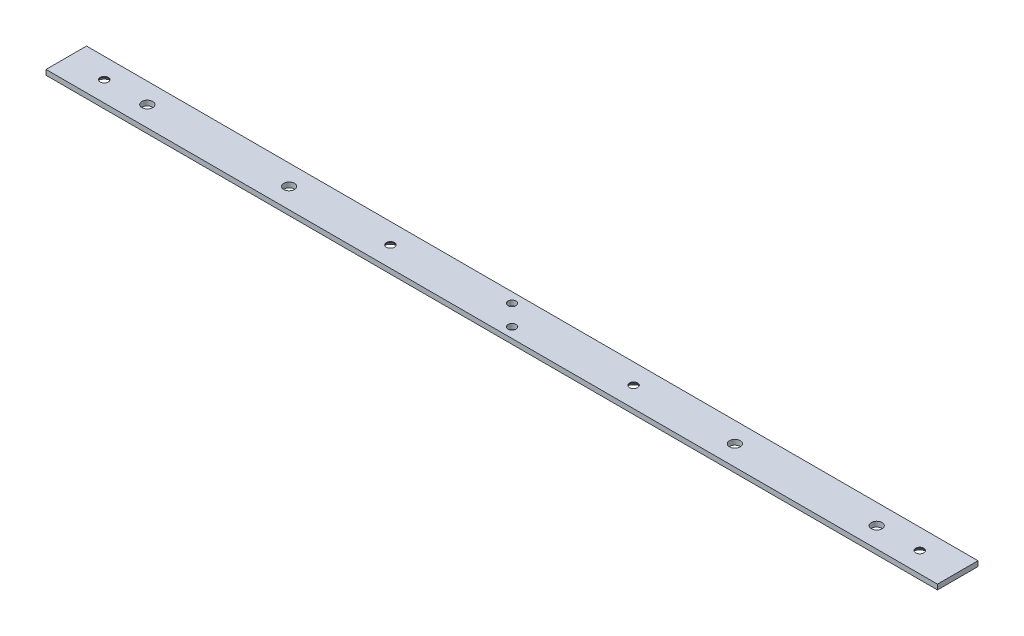
ISO-10303-21;
HEADER;
FILE_DESCRIPTION(('STEP AP214'),'2;1');
FILE_NAME('part.step','',(''),(''),'','','');
FILE_SCHEMA(('AUTOMOTIVE_DESIGN { 1 0 10303 214 1 1 1 1 }'));
ENDSEC;
DATA;
#1=APPLICATION_CONTEXT('core data for automotive mechanical design processes');
#2=APPLICATION_PROTOCOL_DEFINITION('international standard','automotive_design',2000,#1);
#3=PRODUCT_CONTEXT('',#1,'mechanical');
#4=PRODUCT('Part','Part','',(#3));
#5=PRODUCT_RELATED_PRODUCT_CATEGORY('part','',(#4));
#6=PRODUCT_DEFINITION_FORMATION('','',#4);
#7=PRODUCT_DEFINITION_CONTEXT('part definition',#1,'design');
#8=PRODUCT_DEFINITION('design','',#6,#7);
#9=PRODUCT_DEFINITION_SHAPE('','',#8);
#10=(LENGTH_UNIT() NAMED_UNIT(*) SI_UNIT(.MILLI.,.METRE.));
#11=(NAMED_UNIT(*) PLANE_ANGLE_UNIT() SI_UNIT($,.RADIAN.));
#12=(NAMED_UNIT(*) SI_UNIT($,.STERADIAN.) SOLID_ANGLE_UNIT());
#13=UNCERTAINTY_MEASURE_WITH_UNIT(LENGTH_MEASURE(1.E-05),#10,'distance_accuracy_value','');
#14=(GEOMETRIC_REPRESENTATION_CONTEXT(3) GLOBAL_UNCERTAINTY_ASSIGNED_CONTEXT((#13)) GLOBAL_UNIT_ASSIGNED_CONTEXT((#10,
#11,#12)) REPRESENTATION_CONTEXT('',''));
#15=CARTESIAN_POINT('',(0.,0.,0.));
#16=DIRECTION('',(0.,0.,1.));
#17=DIRECTION('',(1.,0.,0.));
#18=AXIS2_PLACEMENT_3D('',#15,#16,#17);
#19=CARTESIAN_POINT('',(279.4,1.5875,12.7));
#20=DIRECTION('',(0.,-1.,0.));
#21=DIRECTION('',(0.,0.,-1.));
#22=AXIS2_PLACEMENT_3D('',#19,#20,#21);
#23=PLANE('',#22);
#24=CARTESIAN_POINT('',(-76.2,1.58749999999999,3.46944695195361E-12));
#25=DIRECTION('',(0.,-1.,0.));
#26=DIRECTION('',(0.,0.,-1.));
#27=AXIS2_PLACEMENT_3D('',#24,#25,#26);
#28=CIRCLE('',#27,2.55269999999999);
#29=CARTESIAN_POINT('',(-76.2,1.58749999999999,-2.55269999999652));
#30=VERTEX_POINT('',#29);
#31=EDGE_CURVE('E188',#30,#30,#28,.T.);
#32=ORIENTED_EDGE('',*,*,#31,.T.);
#33=EDGE_LOOP('',(#32));
#34=FACE_BOUND('',#33,.T.);
#35=CARTESIAN_POINT('',(-255.5875,1.58749999999999,3.44169137633799E-12));
#36=DIRECTION('',(0.,-1.,0.));
#37=DIRECTION('',(0.,0.,-1.));
#38=AXIS2_PLACEMENT_3D('',#35,#36,#37);
#39=CIRCLE('',#38,2.55269999999996);
#40=CARTESIAN_POINT('',(-255.5875,1.58749999999999,-2.55269999999652));
#41=VERTEX_POINT('',#40);
#42=EDGE_CURVE('E179',#41,#41,#39,.T.);
#43=ORIENTED_EDGE('',*,*,#42,.T.);
#44=EDGE_LOOP('',(#43));
#45=FACE_BOUND('',#44,.T.);
#46=CARTESIAN_POINT('',(255.5875,1.58749999999999,3.4555691641458E-12));
#47=DIRECTION('',(0.,-1.,0.));
#48=DIRECTION('',(0.,0.,-1.));
#49=AXIS2_PLACEMENT_3D('',#46,#47,#48);
#50=CIRCLE('',#49,2.55269999999996);
#51=CARTESIAN_POINT('',(255.5875,1.58749999999999,-2.55269999999651));
#52=VERTEX_POINT('',#51);
#53=EDGE_CURVE('E170',#52,#52,#50,.T.);
#54=ORIENTED_EDGE('',*,*,#53,.T.);
#55=EDGE_LOOP('',(#54));
#56=FACE_BOUND('',#55,.T.);
#57=CARTESIAN_POINT('',(76.2,1.58749999999999,3.48332473976143E-12));
#58=DIRECTION('',(0.,-1.,0.));
#59=DIRECTION('',(0.,0.,-1.));
#60=AXIS2_PLACEMENT_3D('',#57,#58,#59);
#61=CIRCLE('',#60,2.55269999999999);
#62=CARTESIAN_POINT('',(76.2,1.58749999999999,-2.55269999999651));
#63=VERTEX_POINT('',#62);
#64=EDGE_CURVE('E161',#63,#63,#61,.T.);
#65=ORIENTED_EDGE('',*,*,#64,.T.);
#66=EDGE_LOOP('',(#65));
#67=FACE_BOUND('',#66,.T.);
#68=CARTESIAN_POINT('',(6.35,1.5875,6.35));
#69=DIRECTION('',(0.,1.,0.));
#70=DIRECTION('',(0.,0.,1.));
#71=AXIS2_PLACEMENT_3D('',#68,#69,#70);
#72=CIRCLE('',#71,2.5527);
#73=CARTESIAN_POINT('',(6.35,1.5875,8.9027));
#74=VERTEX_POINT('',#73);
#75=EDGE_CURVE('E158',#74,#74,#72,.T.);
#76=ORIENTED_EDGE('',*,*,#75,.F.);
#77=EDGE_LOOP('',(#76));
#78=FACE_BOUND('',#77,.T.);
#79=CARTESIAN_POINT('',(-6.35,1.5875,-6.35));
#80=DIRECTION('',(0.,1.,0.));
#81=DIRECTION('',(0.,0.,1.));
#82=AXIS2_PLACEMENT_3D('',#79,#80,#81);
#83=CIRCLE('',#82,2.5527);
#84=CARTESIAN_POINT('',(-6.35,1.5875,-3.7973));
#85=VERTEX_POINT('',#84);
#86=EDGE_CURVE('E152',#85,#85,#83,.T.);
#87=ORIENTED_EDGE('',*,*,#86,.F.);
#88=EDGE_LOOP('',(#87));
#89=FACE_BOUND('',#88,.T.);
#90=CARTESIAN_POINT('',(139.7,1.5875,0.));
#91=DIRECTION('',(0.,1.,0.));
#92=DIRECTION('',(0.,0.,1.));
#93=AXIS2_PLACEMENT_3D('',#90,#91,#92);
#94=CIRCLE('',#93,3.3782);
#95=CARTESIAN_POINT('',(139.7,1.5875,3.3781999999999));
#96=VERTEX_POINT('',#95);
#97=EDGE_CURVE('E140',#96,#96,#94,.T.);
#98=ORIENTED_EDGE('',*,*,#97,.F.);
#99=EDGE_LOOP('',(#98));
#100=FACE_BOUND('',#99,.T.);
#101=CARTESIAN_POINT('',(-228.6,1.5875,0.));
#102=DIRECTION('',(0.,1.,0.));
#103=DIRECTION('',(0.,0.,1.));
#104=AXIS2_PLACEMENT_3D('',#101,#102,#103);
#105=CIRCLE('',#104,3.3782);
#106=CARTESIAN_POINT('',(-228.6,1.5875,3.3782));
#107=VERTEX_POINT('',#106);
#108=EDGE_CURVE('E134',#107,#107,#105,.T.);
#109=ORIENTED_EDGE('',*,*,#108,.F.);
#110=EDGE_LOOP('',(#109));
#111=FACE_BOUND('',#110,.T.);
#112=CARTESIAN_POINT('',(-139.7,1.5875,0.));
#113=DIRECTION('',(0.,1.,0.));
#114=DIRECTION('',(0.,0.,1.));
#115=AXIS2_PLACEMENT_3D('',#112,#113,#114);
#116=CIRCLE('',#115,3.3782);
#117=CARTESIAN_POINT('',(-139.7,1.5875,3.3781999999999));
#118=VERTEX_POINT('',#117);
#119=EDGE_CURVE('E128',#118,#118,#116,.T.);
#120=ORIENTED_EDGE('',*,*,#119,.F.);
#121=EDGE_LOOP('',(#120));
#122=FACE_BOUND('',#121,.T.);
#123=DIRECTION('',(0.,0.,1.));
#124=VECTOR('',#123,1.);
#125=CARTESIAN_POINT('',(-279.4,1.5875,12.7));
#126=LINE('',#125,#124);
#127=CARTESIAN_POINT('',(-279.4,1.5875,-12.7));
#128=VERTEX_POINT('',#127);
#129=CARTESIAN_POINT('',(-279.4,1.5875,12.7));
#130=VERTEX_POINT('',#129);
#131=EDGE_CURVE('E104',#128,#130,#126,.T.);
#132=ORIENTED_EDGE('',*,*,#131,.T.);
#133=DIRECTION('',(-1.,0.,0.));
#134=VECTOR('',#133,1.);
#135=CARTESIAN_POINT('',(279.4,1.5875,12.7));
#136=LINE('',#135,#134);
#137=CARTESIAN_POINT('',(279.4,1.5875,12.7));
#138=VERTEX_POINT('',#137);
#139=EDGE_CURVE('E57',#138,#130,#136,.T.);
#140=ORIENTED_EDGE('',*,*,#139,.F.);
#141=DIRECTION('',(0.,0.,1.));
#142=VECTOR('',#141,1.);
#143=CARTESIAN_POINT('',(279.4,1.5875,12.7));
#144=LINE('',#143,#142);
#145=CARTESIAN_POINT('',(279.4,1.5875,-12.7));
#146=VERTEX_POINT('',#145);
#147=EDGE_CURVE('E95',#146,#138,#144,.T.);
#148=ORIENTED_EDGE('',*,*,#147,.F.);
#149=DIRECTION('',(-1.,0.,0.));
#150=VECTOR('',#149,1.);
#151=CARTESIAN_POINT('',(279.4,1.5875,-12.7));
#152=LINE('',#151,#150);
#153=EDGE_CURVE('E13',#146,#128,#152,.T.);
#154=ORIENTED_EDGE('',*,*,#153,.T.);
#155=EDGE_LOOP('',(#132,#140,#148,#154));
#156=FACE_BOUND('',#155,.T.);
#157=CARTESIAN_POINT('',(228.6,1.5875,0.));
#158=DIRECTION('',(0.,1.,0.));
#159=DIRECTION('',(0.,0.,1.));
#160=AXIS2_PLACEMENT_3D('',#157,#158,#159);
#161=CIRCLE('',#160,3.3782);
#162=CARTESIAN_POINT('',(228.6,1.5875,3.3782));
#163=VERTEX_POINT('',#162);
#164=EDGE_CURVE('E146',#163,#163,#161,.T.);
#165=ORIENTED_EDGE('',*,*,#164,.F.);
#166=EDGE_LOOP('',(#165));
#167=FACE_BOUND('',#166,.T.);
#168=ADVANCED_FACE('F48',(#34,#45,#56,#67,#78,#89,#100,#111,#122,#156,#167),#23,.F.);
#169=CARTESIAN_POINT('',(279.4,1.5875,-12.7));
#170=DIRECTION('',(0.,0.,1.));
#171=DIRECTION('',(1.,0.,0.));
#172=AXIS2_PLACEMENT_3D('',#169,#170,#171);
#173=PLANE('',#172);
#174=DIRECTION('',(0.,1.,0.));
#175=VECTOR('',#174,1.);
#176=CARTESIAN_POINT('',(-279.4,1.5875,-12.7));
#177=LINE('',#176,#175);
#178=CARTESIAN_POINT('',(-279.4,-1.5875,-12.7));
#179=VERTEX_POINT('',#178);
#180=EDGE_CURVE('E112',#179,#128,#177,.T.);
#181=ORIENTED_EDGE('',*,*,#180,.T.);
#182=ORIENTED_EDGE('',*,*,#153,.F.);
#183=DIRECTION('',(0.,1.,0.));
#184=VECTOR('',#183,1.);
#185=CARTESIAN_POINT('',(279.4,1.5875,-12.7));
#186=LINE('',#185,#184);
#187=CARTESIAN_POINT('',(279.4,-1.5875,-12.7));
#188=VERTEX_POINT('',#187);
#189=EDGE_CURVE('E100',#188,#146,#186,.T.);
#190=ORIENTED_EDGE('',*,*,#189,.F.);
#191=DIRECTION('',(-1.,0.,0.));
#192=VECTOR('',#191,1.);
#193=CARTESIAN_POINT('',(279.4,-1.5875,-12.7));
#194=LINE('',#193,#192);
#195=EDGE_CURVE('E108',#188,#179,#194,.T.);
#196=ORIENTED_EDGE('',*,*,#195,.T.);
#197=EDGE_LOOP('',(#181,#182,#190,#196));
#198=FACE_BOUND('',#197,.T.);
#199=ADVANCED_FACE('F50',(#198),#173,.F.);
#200=CARTESIAN_POINT('',(279.4,1.5875,12.7));
#201=DIRECTION('',(0.,0.,-1.));
#202=DIRECTION('',(-1.,0.,0.));
#203=AXIS2_PLACEMENT_3D('',#200,#201,#202);
#204=PLANE('',#203);
#205=DIRECTION('',(0.,-1.,0.));
#206=VECTOR('',#205,1.);
#207=CARTESIAN_POINT('',(-279.4,1.5875,12.7));
#208=LINE('',#207,#206);
#209=CARTESIAN_POINT('',(-279.4,-1.5875,12.7));
#210=VERTEX_POINT('',#209);
#211=EDGE_CURVE('E82',#130,#210,#208,.T.);
#212=ORIENTED_EDGE('',*,*,#211,.T.);
#213=DIRECTION('',(-1.,0.,0.));
#214=VECTOR('',#213,1.);
#215=CARTESIAN_POINT('',(279.4,-1.5875,12.7));
#216=LINE('',#215,#214);
#217=CARTESIAN_POINT('',(279.4,-1.5875,12.7));
#218=VERTEX_POINT('',#217);
#219=EDGE_CURVE('E105',#218,#210,#216,.T.);
#220=ORIENTED_EDGE('',*,*,#219,.F.);
#221=DIRECTION('',(0.,-1.,0.));
#222=VECTOR('',#221,1.);
#223=CARTESIAN_POINT('',(279.4,1.5875,12.7));
#224=LINE('',#223,#222);
#225=EDGE_CURVE('E98',#138,#218,#224,.T.);
#226=ORIENTED_EDGE('',*,*,#225,.F.);
#227=ORIENTED_EDGE('',*,*,#139,.T.);
#228=EDGE_LOOP('',(#212,#220,#226,#227));
#229=FACE_BOUND('',#228,.T.);
#230=ADVANCED_FACE('F106',(#229),#204,.F.);
#231=CARTESIAN_POINT('',(279.4,-1.5875,12.7));
#232=DIRECTION('',(0.,1.,0.));
#233=DIRECTION('',(0.,0.,1.));
#234=AXIS2_PLACEMENT_3D('',#231,#232,#233);
#235=PLANE('',#234);
#236=CARTESIAN_POINT('',(-76.2,-1.58749999999999,3.46944695195361E-12));
#237=DIRECTION('',(0.,-1.,0.));
#238=DIRECTION('',(0.,0.,-1.));
#239=AXIS2_PLACEMENT_3D('',#236,#237,#238);
#240=CIRCLE('',#239,4.88950000000001);
#241=CARTESIAN_POINT('',(-76.2,-1.58749999999999,-4.88949999999654));
#242=VERTEX_POINT('',#241);
#243=EDGE_CURVE('E194',#242,#242,#240,.T.);
#244=ORIENTED_EDGE('',*,*,#243,.F.);
#245=EDGE_LOOP('',(#244));
#246=FACE_BOUND('',#245,.T.);
#247=CARTESIAN_POINT('',(-255.5875,-1.58749999999999,3.44169137633799E-12));
#248=DIRECTION('',(0.,-1.,0.));
#249=DIRECTION('',(0.,0.,-1.));
#250=AXIS2_PLACEMENT_3D('',#247,#248,#249);
#251=CIRCLE('',#250,4.88949999999999);
#252=CARTESIAN_POINT('',(-255.5875,-1.58749999999999,-4.88949999999655));
#253=VERTEX_POINT('',#252);
#254=EDGE_CURVE('E185',#253,#253,#251,.T.);
#255=ORIENTED_EDGE('',*,*,#254,.F.);
#256=EDGE_LOOP('',(#255));
#257=FACE_BOUND('',#256,.T.);
#258=CARTESIAN_POINT('',(255.5875,-1.58749999999999,3.4555691641458E-12));
#259=DIRECTION('',(0.,-1.,0.));
#260=DIRECTION('',(0.,0.,-1.));
#261=AXIS2_PLACEMENT_3D('',#258,#259,#260);
#262=CIRCLE('',#261,4.88949999999999);
#263=CARTESIAN_POINT('',(255.5875,-1.58749999999999,-4.88949999999654));
#264=VERTEX_POINT('',#263);
#265=EDGE_CURVE('E176',#264,#264,#262,.T.);
#266=ORIENTED_EDGE('',*,*,#265,.F.);
#267=EDGE_LOOP('',(#266));
#268=FACE_BOUND('',#267,.T.);
#269=CARTESIAN_POINT('',(76.2,-1.58749999999999,3.48332473976143E-12));
#270=DIRECTION('',(0.,-1.,0.));
#271=DIRECTION('',(0.,0.,-1.));
#272=AXIS2_PLACEMENT_3D('',#269,#270,#271);
#273=CIRCLE('',#272,4.88950000000001);
#274=CARTESIAN_POINT('',(76.2,-1.58749999999999,-4.88949999999652));
#275=VERTEX_POINT('',#274);
#276=EDGE_CURVE('E167',#275,#275,#273,.T.);
#277=ORIENTED_EDGE('',*,*,#276,.F.);
#278=EDGE_LOOP('',(#277));
#279=FACE_BOUND('',#278,.T.);
#280=CARTESIAN_POINT('',(6.35,-1.5875,6.35));
#281=DIRECTION('',(0.,1.,0.));
#282=DIRECTION('',(0.,0.,1.));
#283=AXIS2_PLACEMENT_3D('',#280,#281,#282);
#284=CIRCLE('',#283,2.5527);
#285=CARTESIAN_POINT('',(6.35,-1.5875,8.9027));
#286=VERTEX_POINT('',#285);
#287=EDGE_CURVE('E155',#286,#286,#284,.T.);
#288=ORIENTED_EDGE('',*,*,#287,.T.);
#289=EDGE_LOOP('',(#288));
#290=FACE_BOUND('',#289,.T.);
#291=CARTESIAN_POINT('',(-6.35,-1.5875,-6.35));
#292=DIRECTION('',(0.,1.,0.));
#293=DIRECTION('',(0.,0.,1.));
#294=AXIS2_PLACEMENT_3D('',#291,#292,#293);
#295=CIRCLE('',#294,2.5527);
#296=CARTESIAN_POINT('',(-6.35,-1.5875,-3.7973));
#297=VERTEX_POINT('',#296);
#298=EDGE_CURVE('E149',#297,#297,#295,.T.);
#299=ORIENTED_EDGE('',*,*,#298,.T.);
#300=EDGE_LOOP('',(#299));
#301=FACE_BOUND('',#300,.T.);
#302=CARTESIAN_POINT('',(228.6,-1.5875,0.));
#303=DIRECTION('',(0.,1.,0.));
#304=DIRECTION('',(0.,0.,1.));
#305=AXIS2_PLACEMENT_3D('',#302,#303,#304);
#306=CIRCLE('',#305,3.3782);
#307=CARTESIAN_POINT('',(228.6,-1.5875,3.3782));
#308=VERTEX_POINT('',#307);
#309=EDGE_CURVE('E143',#308,#308,#306,.T.);
#310=ORIENTED_EDGE('',*,*,#309,.T.);
#311=EDGE_LOOP('',(#310));
#312=FACE_BOUND('',#311,.T.);
#313=CARTESIAN_POINT('',(139.7,-1.5875,0.));
#314=DIRECTION('',(0.,1.,0.));
#315=DIRECTION('',(0.,0.,1.));
#316=AXIS2_PLACEMENT_3D('',#313,#314,#315);
#317=CIRCLE('',#316,3.3782);
#318=CARTESIAN_POINT('',(139.7,-1.5875,3.3781999999999));
#319=VERTEX_POINT('',#318);
#320=EDGE_CURVE('E137',#319,#319,#317,.T.);
#321=ORIENTED_EDGE('',*,*,#320,.T.);
#322=EDGE_LOOP('',(#321));
#323=FACE_BOUND('',#322,.T.);
#324=CARTESIAN_POINT('',(-228.6,-1.5875,0.));
#325=DIRECTION('',(0.,1.,0.));
#326=DIRECTION('',(0.,0.,1.));
#327=AXIS2_PLACEMENT_3D('',#324,#325,#326);
#328=CIRCLE('',#327,3.3782);
#329=CARTESIAN_POINT('',(-228.6,-1.5875,3.3782));
#330=VERTEX_POINT('',#329);
#331=EDGE_CURVE('E131',#330,#330,#328,.T.);
#332=ORIENTED_EDGE('',*,*,#331,.T.);
#333=EDGE_LOOP('',(#332));
#334=FACE_BOUND('',#333,.T.);
#335=CARTESIAN_POINT('',(-139.7,-1.5875,0.));
#336=DIRECTION('',(0.,1.,0.));
#337=DIRECTION('',(0.,0.,1.));
#338=AXIS2_PLACEMENT_3D('',#335,#336,#337);
#339=CIRCLE('',#338,3.3782);
#340=CARTESIAN_POINT('',(-139.7,-1.5875,3.3781999999999));
#341=VERTEX_POINT('',#340);
#342=EDGE_CURVE('E115',#341,#341,#339,.T.);
#343=ORIENTED_EDGE('',*,*,#342,.T.);
#344=EDGE_LOOP('',(#343));
#345=FACE_BOUND('',#344,.T.);
#346=DIRECTION('',(0.,0.,-1.));
#347=VECTOR('',#346,1.);
#348=CARTESIAN_POINT('',(-279.4,-1.5875,12.7));
#349=LINE('',#348,#347);
#350=EDGE_CURVE('E88',#210,#179,#349,.T.);
#351=ORIENTED_EDGE('',*,*,#350,.T.);
#352=ORIENTED_EDGE('',*,*,#195,.F.);
#353=DIRECTION('',(0.,0.,-1.));
#354=VECTOR('',#353,1.);
#355=CARTESIAN_POINT('',(279.4,-1.5875,12.7));
#356=LINE('',#355,#354);
#357=EDGE_CURVE('E65',#218,#188,#356,.T.);
#358=ORIENTED_EDGE('',*,*,#357,.F.);
#359=ORIENTED_EDGE('',*,*,#219,.T.);
#360=EDGE_LOOP('',(#351,#352,#358,#359));
#361=FACE_BOUND('',#360,.T.);
#362=ADVANCED_FACE('F120',(#246,#257,#268,#279,#290,#301,#312,#323,#334,#345,#361),#235,.F.);
#363=CARTESIAN_POINT('',(279.4,0.,0.));
#364=DIRECTION('',(1.,0.,0.));
#365=DIRECTION('',(0.,0.,-1.));
#366=AXIS2_PLACEMENT_3D('',#363,#364,#365);
#367=PLANE('',#366);
#368=ORIENTED_EDGE('',*,*,#189,.T.);
#369=ORIENTED_EDGE('',*,*,#147,.T.);
#370=ORIENTED_EDGE('',*,*,#225,.T.);
#371=ORIENTED_EDGE('',*,*,#357,.T.);
#372=EDGE_LOOP('',(#368,#369,#370,#371));
#373=FACE_BOUND('',#372,.T.);
#374=ADVANCED_FACE('F96',(#373),#367,.T.);
#375=CARTESIAN_POINT('',(-279.4,0.,0.));
#376=DIRECTION('',(1.,0.,0.));
#377=DIRECTION('',(0.,0.,-1.));
#378=AXIS2_PLACEMENT_3D('',#375,#376,#377);
#379=PLANE('',#378);
#380=ORIENTED_EDGE('',*,*,#180,.F.);
#381=ORIENTED_EDGE('',*,*,#350,.F.);
#382=ORIENTED_EDGE('',*,*,#211,.F.);
#383=ORIENTED_EDGE('',*,*,#131,.F.);
#384=EDGE_LOOP('',(#380,#381,#382,#383));
#385=FACE_BOUND('',#384,.T.);
#386=ADVANCED_FACE('F123',(#385),#379,.F.);
#387=CARTESIAN_POINT('',(-139.7,1.5875,0.));
#388=DIRECTION('',(0.,1.,0.));
#389=DIRECTION('',(0.,0.,1.));
#390=AXIS2_PLACEMENT_3D('',#387,#388,#389);
#391=CYLINDRICAL_SURFACE('',#390,3.3782);
#392=ORIENTED_EDGE('',*,*,#342,.F.);
#393=EDGE_LOOP('',(#392));
#394=FACE_BOUND('',#393,.T.);
#395=ORIENTED_EDGE('',*,*,#119,.T.);
#396=EDGE_LOOP('',(#395));
#397=FACE_BOUND('',#396,.T.);
#398=ADVANCED_FACE('F221',(#394,#397),#391,.F.);
#399=CARTESIAN_POINT('',(-228.6,1.5875,0.));
#400=DIRECTION('',(0.,1.,0.));
#401=DIRECTION('',(0.,0.,1.));
#402=AXIS2_PLACEMENT_3D('',#399,#400,#401);
#403=CYLINDRICAL_SURFACE('',#402,3.3782);
#404=ORIENTED_EDGE('',*,*,#331,.F.);
#405=EDGE_LOOP('',(#404));
#406=FACE_BOUND('',#405,.T.);
#407=ORIENTED_EDGE('',*,*,#108,.T.);
#408=EDGE_LOOP('',(#407));
#409=FACE_BOUND('',#408,.T.);
#410=ADVANCED_FACE('F224',(#406,#409),#403,.F.);
#411=CARTESIAN_POINT('',(139.7,1.5875,0.));
#412=DIRECTION('',(0.,1.,0.));
#413=DIRECTION('',(0.,0.,1.));
#414=AXIS2_PLACEMENT_3D('',#411,#412,#413);
#415=CYLINDRICAL_SURFACE('',#414,3.3782);
#416=ORIENTED_EDGE('',*,*,#320,.F.);
#417=EDGE_LOOP('',(#416));
#418=FACE_BOUND('',#417,.T.);
#419=ORIENTED_EDGE('',*,*,#97,.T.);
#420=EDGE_LOOP('',(#419));
#421=FACE_BOUND('',#420,.T.);
#422=ADVANCED_FACE('F242',(#418,#421),#415,.F.);
#423=CARTESIAN_POINT('',(228.6,1.5875,0.));
#424=DIRECTION('',(0.,1.,0.));
#425=DIRECTION('',(0.,0.,1.));
#426=AXIS2_PLACEMENT_3D('',#423,#424,#425);
#427=CYLINDRICAL_SURFACE('',#426,3.3782);
#428=ORIENTED_EDGE('',*,*,#309,.F.);
#429=EDGE_LOOP('',(#428));
#430=FACE_BOUND('',#429,.T.);
#431=ORIENTED_EDGE('',*,*,#164,.T.);
#432=EDGE_LOOP('',(#431));
#433=FACE_BOUND('',#432,.T.);
#434=ADVANCED_FACE('F246',(#430,#433),#427,.F.);
#435=CARTESIAN_POINT('',(-6.35,1.5875,-6.35));
#436=DIRECTION('',(0.,1.,0.));
#437=DIRECTION('',(0.,0.,1.));
#438=AXIS2_PLACEMENT_3D('',#435,#436,#437);
#439=CYLINDRICAL_SURFACE('',#438,2.5527);
#440=ORIENTED_EDGE('',*,*,#298,.F.);
#441=EDGE_LOOP('',(#440));
#442=FACE_BOUND('',#441,.T.);
#443=ORIENTED_EDGE('',*,*,#86,.T.);
#444=EDGE_LOOP('',(#443));
#445=FACE_BOUND('',#444,.T.);
#446=ADVANCED_FACE('F250',(#442,#445),#439,.F.);
#447=CARTESIAN_POINT('',(6.35,1.5875,6.35));
#448=DIRECTION('',(0.,1.,0.));
#449=DIRECTION('',(0.,0.,1.));
#450=AXIS2_PLACEMENT_3D('',#447,#448,#449);
#451=CYLINDRICAL_SURFACE('',#450,2.5527);
#452=ORIENTED_EDGE('',*,*,#287,.F.);
#453=EDGE_LOOP('',(#452));
#454=FACE_BOUND('',#453,.T.);
#455=ORIENTED_EDGE('',*,*,#75,.T.);
#456=EDGE_LOOP('',(#455));
#457=FACE_BOUND('',#456,.T.);
#458=ADVANCED_FACE('F254',(#454,#457),#451,.F.);
#459=CARTESIAN_POINT('',(76.2,-1.58749999999999,3.48332473976143E-12));
#460=DIRECTION('',(0.,-1.,0.));
#461=DIRECTION('',(0.,0.,-1.));
#462=AXIS2_PLACEMENT_3D('',#459,#460,#461);
#463=CYLINDRICAL_SURFACE('',#462,2.5527);
#464=ORIENTED_EDGE('',*,*,#64,.F.);
#465=EDGE_LOOP('',(#464));
#466=FACE_BOUND('',#465,.T.);
#467=CARTESIAN_POINT('',(76.2,1.10068089399407,3.48332473976143E-12));
#468=DIRECTION('',(0.,-1.,0.));
#469=DIRECTION('',(0.,0.,-1.));
#470=AXIS2_PLACEMENT_3D('',#467,#468,#469);
#471=CIRCLE('',#470,2.55270000000001);
#472=CARTESIAN_POINT('',(76.2,1.10068089399407,-2.55269999999652));
#473=VERTEX_POINT('',#472);
#474=EDGE_CURVE('E164',#473,#473,#471,.T.);
#475=ORIENTED_EDGE('',*,*,#474,.T.);
#476=EDGE_LOOP('',(#475));
#477=FACE_BOUND('',#476,.T.);
#478=ADVANCED_FACE('F258',(#466,#477),#463,.F.);
#479=CARTESIAN_POINT('',(76.2,-1.58749999999999,3.48332473976143E-12));
#480=DIRECTION('',(0.,-1.,0.));
#481=DIRECTION('',(0.,0.,-1.));
#482=AXIS2_PLACEMENT_3D('',#479,#480,#481);
#483=CONICAL_SURFACE('',#482,4.88950000000001,0.715584993317675);
#484=ORIENTED_EDGE('',*,*,#474,.F.);
#485=EDGE_LOOP('',(#484));
#486=FACE_BOUND('',#485,.T.);
#487=ORIENTED_EDGE('',*,*,#276,.T.);
#488=EDGE_LOOP('',(#487));
#489=FACE_BOUND('',#488,.T.);
#490=ADVANCED_FACE('F262',(#486,#489),#483,.F.);
#491=CARTESIAN_POINT('',(255.5875,-1.58749999999999,3.4555691641458E-12));
#492=DIRECTION('',(0.,-1.,0.));
#493=DIRECTION('',(0.,0.,-1.));
#494=AXIS2_PLACEMENT_3D('',#491,#492,#493);
#495=CYLINDRICAL_SURFACE('',#494,2.55269999999999);
#496=ORIENTED_EDGE('',*,*,#53,.F.);
#497=EDGE_LOOP('',(#496));
#498=FACE_BOUND('',#497,.T.);
#499=CARTESIAN_POINT('',(255.5875,1.10068089399407,3.4555691641458E-12));
#500=DIRECTION('',(0.,-1.,0.));
#501=DIRECTION('',(0.,0.,-1.));
#502=AXIS2_PLACEMENT_3D('',#499,#500,#501);
#503=CIRCLE('',#502,2.55270000000002);
#504=CARTESIAN_POINT('',(255.5875,1.10068089399407,-2.55269999999656));
#505=VERTEX_POINT('',#504);
#506=EDGE_CURVE('E173',#505,#505,#503,.T.);
#507=ORIENTED_EDGE('',*,*,#506,.T.);
#508=EDGE_LOOP('',(#507));
#509=FACE_BOUND('',#508,.T.);
#510=ADVANCED_FACE('F266',(#498,#509),#495,.F.);
#511=CARTESIAN_POINT('',(255.5875,-1.58749999999999,3.4555691641458E-12));
#512=DIRECTION('',(0.,-1.,0.));
#513=DIRECTION('',(0.,0.,-1.));
#514=AXIS2_PLACEMENT_3D('',#511,#512,#513);
#515=CONICAL_SURFACE('',#514,4.88949999999999,0.715584993317669);
#516=ORIENTED_EDGE('',*,*,#506,.F.);
#517=EDGE_LOOP('',(#516));
#518=FACE_BOUND('',#517,.T.);
#519=ORIENTED_EDGE('',*,*,#265,.T.);
#520=EDGE_LOOP('',(#519));
#521=FACE_BOUND('',#520,.T.);
#522=ADVANCED_FACE('F270',(#518,#521),#515,.F.);
#523=CARTESIAN_POINT('',(-255.5875,-1.58749999999999,3.44169137633799E-12));
#524=DIRECTION('',(0.,-1.,0.));
#525=DIRECTION('',(0.,0.,-1.));
#526=AXIS2_PLACEMENT_3D('',#523,#524,#525);
#527=CYLINDRICAL_SURFACE('',#526,2.55269999999999);
#528=ORIENTED_EDGE('',*,*,#42,.F.);
#529=EDGE_LOOP('',(#528));
#530=FACE_BOUND('',#529,.T.);
#531=CARTESIAN_POINT('',(-255.5875,1.10068089399407,3.44169137633799E-12));
#532=DIRECTION('',(0.,-1.,0.));
#533=DIRECTION('',(0.,0.,-1.));
#534=AXIS2_PLACEMENT_3D('',#531,#532,#533);
#535=CIRCLE('',#534,2.55270000000002);
#536=CARTESIAN_POINT('',(-255.5875,1.10068089399407,-2.55269999999658));
#537=VERTEX_POINT('',#536);
#538=EDGE_CURVE('E182',#537,#537,#535,.T.);
#539=ORIENTED_EDGE('',*,*,#538,.T.);
#540=EDGE_LOOP('',(#539));
#541=FACE_BOUND('',#540,.T.);
#542=ADVANCED_FACE('F274',(#530,#541),#527,.F.);
#543=CARTESIAN_POINT('',(-255.5875,-1.58749999999999,3.44169137633799E-12));
#544=DIRECTION('',(0.,-1.,0.));
#545=DIRECTION('',(0.,0.,-1.));
#546=AXIS2_PLACEMENT_3D('',#543,#544,#545);
#547=CONICAL_SURFACE('',#546,4.88949999999999,0.715584993317669);
#548=ORIENTED_EDGE('',*,*,#538,.F.);
#549=EDGE_LOOP('',(#548));
#550=FACE_BOUND('',#549,.T.);
#551=ORIENTED_EDGE('',*,*,#254,.T.);
#552=EDGE_LOOP('',(#551));
#553=FACE_BOUND('',#552,.T.);
#554=ADVANCED_FACE('F278',(#550,#553),#547,.F.);
#555=CARTESIAN_POINT('',(-76.2,-1.58749999999999,3.46944695195361E-12));
#556=DIRECTION('',(0.,-1.,0.));
#557=DIRECTION('',(0.,0.,-1.));
#558=AXIS2_PLACEMENT_3D('',#555,#556,#557);
#559=CYLINDRICAL_SURFACE('',#558,2.5527);
#560=ORIENTED_EDGE('',*,*,#31,.F.);
#561=EDGE_LOOP('',(#560));
#562=FACE_BOUND('',#561,.T.);
#563=CARTESIAN_POINT('',(-76.2,1.10068089399407,3.46944695195361E-12));
#564=DIRECTION('',(0.,-1.,0.));
#565=DIRECTION('',(0.,0.,-1.));
#566=AXIS2_PLACEMENT_3D('',#563,#564,#565);
#567=CIRCLE('',#566,2.55270000000001);
#568=CARTESIAN_POINT('',(-76.2,1.10068089399407,-2.55269999999654));
#569=VERTEX_POINT('',#568);
#570=EDGE_CURVE('E191',#569,#569,#567,.T.);
#571=ORIENTED_EDGE('',*,*,#570,.T.);
#572=EDGE_LOOP('',(#571));
#573=FACE_BOUND('',#572,.T.);
#574=ADVANCED_FACE('F282',(#562,#573),#559,.F.);
#575=CARTESIAN_POINT('',(-76.2,-1.58749999999999,3.46944695195361E-12));
#576=DIRECTION('',(0.,-1.,0.));
#577=DIRECTION('',(0.,0.,-1.));
#578=AXIS2_PLACEMENT_3D('',#575,#576,#577);
#579=CONICAL_SURFACE('',#578,4.88950000000001,0.715584993317675);
#580=ORIENTED_EDGE('',*,*,#570,.F.);
#581=EDGE_LOOP('',(#580));
#582=FACE_BOUND('',#581,.T.);
#583=ORIENTED_EDGE('',*,*,#243,.T.);
#584=EDGE_LOOP('',(#583));
#585=FACE_BOUND('',#584,.T.);
#586=ADVANCED_FACE('F198',(#582,#585),#579,.F.);
#587=CLOSED_SHELL('',(#168,#199,#230,#362,#374,#386,#398,#410,#422,#434,#446,#458,#478,#490,
#510,#522,#542,#554,#574,#586));
#588=MANIFOLD_SOLID_BREP('B2',#587);
#589=ADVANCED_BREP_SHAPE_REPRESENTATION('',(#18,#588),#14);
#590=SHAPE_DEFINITION_REPRESENTATION(#9,#589);
ENDSEC;
END-ISO-10303-21;
